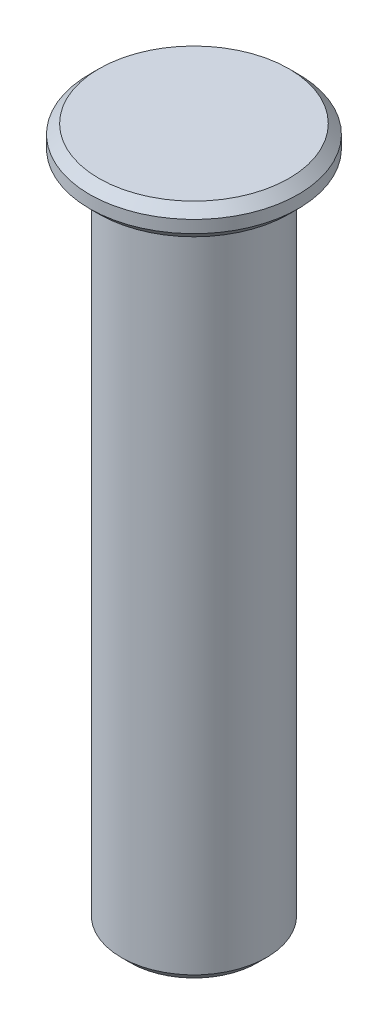
ISO-10303-21;
HEADER;
FILE_DESCRIPTION(('STEP AP214'),'2;1');
FILE_NAME('part.step','',(''),(''),'','','');
FILE_SCHEMA(('AUTOMOTIVE_DESIGN { 1 0 10303 214 1 1 1 1 }'));
ENDSEC;
DATA;
#1=APPLICATION_CONTEXT('core data for automotive mechanical design processes');
#2=APPLICATION_PROTOCOL_DEFINITION('international standard','automotive_design',2000,#1);
#3=PRODUCT_CONTEXT('',#1,'mechanical');
#4=PRODUCT('Part','Part','',(#3));
#5=PRODUCT_RELATED_PRODUCT_CATEGORY('part','',(#4));
#6=PRODUCT_DEFINITION_FORMATION('','',#4);
#7=PRODUCT_DEFINITION_CONTEXT('part definition',#1,'design');
#8=PRODUCT_DEFINITION('design','',#6,#7);
#9=PRODUCT_DEFINITION_SHAPE('','',#8);
#10=(LENGTH_UNIT() NAMED_UNIT(*) SI_UNIT(.MILLI.,.METRE.));
#11=(NAMED_UNIT(*) PLANE_ANGLE_UNIT() SI_UNIT($,.RADIAN.));
#12=(NAMED_UNIT(*) SI_UNIT($,.STERADIAN.) SOLID_ANGLE_UNIT());
#13=UNCERTAINTY_MEASURE_WITH_UNIT(LENGTH_MEASURE(1.E-05),#10,'distance_accuracy_value','');
#14=(GEOMETRIC_REPRESENTATION_CONTEXT(3) GLOBAL_UNCERTAINTY_ASSIGNED_CONTEXT((#13)) GLOBAL_UNIT_ASSIGNED_CONTEXT((#10,
#11,#12)) REPRESENTATION_CONTEXT('',''));
#15=CARTESIAN_POINT('',(0.,0.,0.));
#16=DIRECTION('',(0.,0.,1.));
#17=DIRECTION('',(1.,0.,0.));
#18=AXIS2_PLACEMENT_3D('',#15,#16,#17);
#19=CARTESIAN_POINT('',(0.,45.,0.));
#20=DIRECTION('',(0.,-1.,0.));
#21=DIRECTION('',(0.,0.,-1.));
#22=AXIS2_PLACEMENT_3D('',#19,#20,#21);
#23=CYLINDRICAL_SURFACE('',#22,4.7);
#24=CARTESIAN_POINT('',(0.,0.600000000000024,0.));
#25=DIRECTION('',(0.,1.,0.));
#26=DIRECTION('',(0.,0.,1.));
#27=AXIS2_PLACEMENT_3D('',#24,#25,#26);
#28=CIRCLE('',#27,4.7);
#29=CARTESIAN_POINT('',(0.,0.600000000000024,4.7));
#30=VERTEX_POINT('',#29);
#31=EDGE_CURVE('E53',#30,#30,#28,.T.);
#32=ORIENTED_EDGE('',*,*,#31,.T.);
#33=EDGE_LOOP('',(#32));
#34=FACE_BOUND('',#33,.T.);
#35=CARTESIAN_POINT('',(0.,43.,0.));
#36=DIRECTION('',(0.,1.,0.));
#37=DIRECTION('',(0.,0.,1.));
#38=AXIS2_PLACEMENT_3D('',#35,#36,#37);
#39=CIRCLE('',#38,4.7);
#40=CARTESIAN_POINT('',(0.,43.,4.7));
#41=VERTEX_POINT('',#40);
#42=EDGE_CURVE('E56',#41,#41,#39,.T.);
#43=ORIENTED_EDGE('',*,*,#42,.F.);
#44=EDGE_LOOP('',(#43));
#45=FACE_BOUND('',#44,.T.);
#46=ADVANCED_FACE('F30',(#34,#45),#23,.T.);
#47=CARTESIAN_POINT('',(0.,0.,0.));
#48=DIRECTION('',(0.,1.,0.));
#49=DIRECTION('',(0.,0.,1.));
#50=AXIS2_PLACEMENT_3D('',#47,#48,#49);
#51=PLANE('',#50);
#52=CARTESIAN_POINT('',(0.,0.,0.));
#53=DIRECTION('',(0.,1.,0.));
#54=DIRECTION('',(0.,0.,1.));
#55=AXIS2_PLACEMENT_3D('',#52,#53,#54);
#56=CIRCLE('',#55,4.09999999999997);
#57=CARTESIAN_POINT('',(0.,0.,4.09999999999997));
#58=VERTEX_POINT('',#57);
#59=EDGE_CURVE('E50',#58,#58,#56,.F.);
#60=ORIENTED_EDGE('',*,*,#59,.T.);
#61=EDGE_LOOP('',(#60));
#62=FACE_BOUND('',#61,.T.);
#63=ADVANCED_FACE('F63',(#62),#51,.F.);
#64=CARTESIAN_POINT('',(0.,43.,0.));
#65=DIRECTION('',(0.,1.,0.));
#66=DIRECTION('',(0.,0.,1.));
#67=AXIS2_PLACEMENT_3D('',#64,#65,#66);
#68=PLANE('',#67);
#69=CARTESIAN_POINT('',(0.,43.,0.));
#70=DIRECTION('',(0.,1.,0.));
#71=DIRECTION('',(0.,0.,1.));
#72=AXIS2_PLACEMENT_3D('',#69,#70,#71);
#73=CIRCLE('',#72,6.15);
#74=CARTESIAN_POINT('',(0.,43.,6.15));
#75=VERTEX_POINT('',#74);
#76=EDGE_CURVE('E37',#75,#75,#73,.F.);
#77=ORIENTED_EDGE('',*,*,#76,.T.);
#78=EDGE_LOOP('',(#77));
#79=FACE_BOUND('',#78,.T.);
#80=ORIENTED_EDGE('',*,*,#42,.T.);
#81=EDGE_LOOP('',(#80));
#82=FACE_BOUND('',#81,.T.);
#83=ADVANCED_FACE('F60',(#79,#82),#68,.F.);
#84=CARTESIAN_POINT('',(0.,43.,0.));
#85=DIRECTION('',(0.,1.,0.));
#86=DIRECTION('',(0.,0.,1.));
#87=AXIS2_PLACEMENT_3D('',#84,#85,#86);
#88=CYLINDRICAL_SURFACE('',#87,6.75);
#89=CARTESIAN_POINT('',(0.,43.6,0.));
#90=DIRECTION('',(0.,1.,0.));
#91=DIRECTION('',(0.,0.,1.));
#92=AXIS2_PLACEMENT_3D('',#89,#90,#91);
#93=CIRCLE('',#92,6.75);
#94=CARTESIAN_POINT('',(0.,43.6,6.75));
#95=VERTEX_POINT('',#94);
#96=EDGE_CURVE('E41',#95,#95,#93,.T.);
#97=ORIENTED_EDGE('',*,*,#96,.T.);
#98=EDGE_LOOP('',(#97));
#99=FACE_BOUND('',#98,.T.);
#100=CARTESIAN_POINT('',(0.,44.4,0.));
#101=DIRECTION('',(0.,1.,0.));
#102=DIRECTION('',(0.,0.,1.));
#103=AXIS2_PLACEMENT_3D('',#100,#101,#102);
#104=CIRCLE('',#103,6.75);
#105=CARTESIAN_POINT('',(0.,44.4,6.75));
#106=VERTEX_POINT('',#105);
#107=EDGE_CURVE('E45',#106,#106,#104,.F.);
#108=ORIENTED_EDGE('',*,*,#107,.T.);
#109=EDGE_LOOP('',(#108));
#110=FACE_BOUND('',#109,.T.);
#111=ADVANCED_FACE('F87',(#99,#110),#88,.T.);
#112=CARTESIAN_POINT('',(0.,45.,0.));
#113=DIRECTION('',(0.,1.,0.));
#114=DIRECTION('',(0.,0.,1.));
#115=AXIS2_PLACEMENT_3D('',#112,#113,#114);
#116=PLANE('',#115);
#117=CARTESIAN_POINT('',(0.,45.,0.));
#118=DIRECTION('',(0.,1.,0.));
#119=DIRECTION('',(0.,0.,1.));
#120=AXIS2_PLACEMENT_3D('',#117,#118,#119);
#121=CIRCLE('',#120,6.15);
#122=CARTESIAN_POINT('',(0.,45.,6.15));
#123=VERTEX_POINT('',#122);
#124=EDGE_CURVE('E10',#123,#123,#121,.T.);
#125=ORIENTED_EDGE('',*,*,#124,.T.);
#126=EDGE_LOOP('',(#125));
#127=FACE_BOUND('',#126,.T.);
#128=ADVANCED_FACE('F76',(#127),#116,.T.);
#129=CARTESIAN_POINT('',(0.,0.600000000000024,0.));
#130=DIRECTION('',(0.,1.,0.));
#131=DIRECTION('',(0.,0.,1.));
#132=AXIS2_PLACEMENT_3D('',#129,#130,#131);
#133=CONICAL_SURFACE('',#132,4.7,0.785398163397453);
#134=ORIENTED_EDGE('',*,*,#59,.F.);
#135=EDGE_LOOP('',(#134));
#136=FACE_BOUND('',#135,.T.);
#137=ORIENTED_EDGE('',*,*,#31,.F.);
#138=EDGE_LOOP('',(#137));
#139=FACE_BOUND('',#138,.T.);
#140=ADVANCED_FACE('F73',(#136,#139),#133,.T.);
#141=CARTESIAN_POINT('',(0.,43.6,0.));
#142=DIRECTION('',(0.,1.,0.));
#143=DIRECTION('',(0.,0.,1.));
#144=AXIS2_PLACEMENT_3D('',#141,#142,#143);
#145=CONICAL_SURFACE('',#144,6.75,0.785398163397441);
#146=ORIENTED_EDGE('',*,*,#76,.F.);
#147=EDGE_LOOP('',(#146));
#148=FACE_BOUND('',#147,.T.);
#149=ORIENTED_EDGE('',*,*,#96,.F.);
#150=EDGE_LOOP('',(#149));
#151=FACE_BOUND('',#150,.T.);
#152=ADVANCED_FACE('F75',(#148,#151),#145,.T.);
#153=CARTESIAN_POINT('',(0.,45.,0.));
#154=DIRECTION('',(0.,-1.,0.));
#155=DIRECTION('',(0.,0.,-1.));
#156=AXIS2_PLACEMENT_3D('',#153,#154,#155);
#157=CONICAL_SURFACE('',#156,6.15,0.785398163397449);
#158=ORIENTED_EDGE('',*,*,#107,.F.);
#159=EDGE_LOOP('',(#158));
#160=FACE_BOUND('',#159,.T.);
#161=ORIENTED_EDGE('',*,*,#124,.F.);
#162=EDGE_LOOP('',(#161));
#163=FACE_BOUND('',#162,.T.);
#164=ADVANCED_FACE('F32',(#160,#163),#157,.T.);
#165=CLOSED_SHELL('',(#46,#63,#83,#111,#128,#140,#152,#164));
#166=MANIFOLD_SOLID_BREP('B2',#165);
#167=ADVANCED_BREP_SHAPE_REPRESENTATION('',(#18,#166),#14);
#168=SHAPE_DEFINITION_REPRESENTATION(#9,#167);
ENDSEC;
END-ISO-10303-21;
